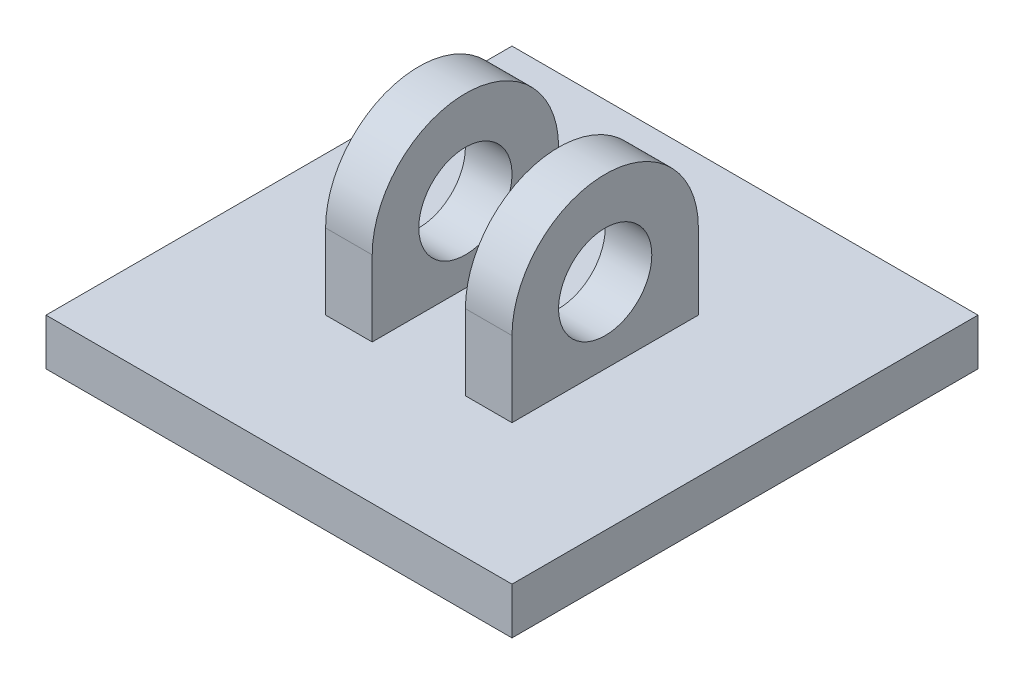
ISO-10303-21;
HEADER;
FILE_DESCRIPTION(('STEP AP214'),'2;1');
FILE_NAME('part.step','',(''),(''),'','','');
FILE_SCHEMA(('AUTOMOTIVE_DESIGN { 1 0 10303 214 1 1 1 1 }'));
ENDSEC;
DATA;
#1=APPLICATION_CONTEXT('core data for automotive mechanical design processes');
#2=APPLICATION_PROTOCOL_DEFINITION('international standard','automotive_design',2000,#1);
#3=PRODUCT_CONTEXT('',#1,'mechanical');
#4=PRODUCT('Part','Part','',(#3));
#5=PRODUCT_RELATED_PRODUCT_CATEGORY('part','',(#4));
#6=PRODUCT_DEFINITION_FORMATION('','',#4);
#7=PRODUCT_DEFINITION_CONTEXT('part definition',#1,'design');
#8=PRODUCT_DEFINITION('design','',#6,#7);
#9=PRODUCT_DEFINITION_SHAPE('','',#8);
#10=(LENGTH_UNIT() NAMED_UNIT(*) SI_UNIT(.MILLI.,.METRE.));
#11=(NAMED_UNIT(*) PLANE_ANGLE_UNIT() SI_UNIT($,.RADIAN.));
#12=(NAMED_UNIT(*) SI_UNIT($,.STERADIAN.) SOLID_ANGLE_UNIT());
#13=UNCERTAINTY_MEASURE_WITH_UNIT(LENGTH_MEASURE(1.E-05),#10,'distance_accuracy_value','');
#14=(GEOMETRIC_REPRESENTATION_CONTEXT(3) GLOBAL_UNCERTAINTY_ASSIGNED_CONTEXT((#13)) GLOBAL_UNIT_ASSIGNED_CONTEXT((#10,
#11,#12)) REPRESENTATION_CONTEXT('',''));
#15=CARTESIAN_POINT('',(0.,0.,0.));
#16=DIRECTION('',(0.,0.,1.));
#17=DIRECTION('',(1.,0.,0.));
#18=AXIS2_PLACEMENT_3D('',#15,#16,#17);
#19=CARTESIAN_POINT('',(-10.,13.097700543262,-25.));
#20=DIRECTION('',(-1.,0.,0.));
#21=DIRECTION('',(0.,0.,-1.));
#22=AXIS2_PLACEMENT_3D('',#19,#20,#21);
#23=PLANE('',#22);
#24=DIRECTION('',(0.,-1.,0.));
#25=VECTOR('',#24,1.);
#26=CARTESIAN_POINT('',(-10.,5.,-15.));
#27=LINE('',#26,#25);
#28=CARTESIAN_POINT('',(-10.,13.097700543262,-15.));
#29=VERTEX_POINT('',#28);
#30=CARTESIAN_POINT('',(-10.,5.,-15.));
#31=VERTEX_POINT('',#30);
#32=EDGE_CURVE('E133',#29,#31,#27,.T.);
#33=ORIENTED_EDGE('',*,*,#32,.F.);
#34=CARTESIAN_POINT('',(-10.,13.097700543262,-25.));
#35=DIRECTION('',(1.,0.,0.));
#36=DIRECTION('',(0.,0.,-1.));
#37=AXIS2_PLACEMENT_3D('',#34,#35,#36);
#38=CIRCLE('',#37,10.);
#39=CARTESIAN_POINT('',(-10.,13.097700543262,-35.));
#40=VERTEX_POINT('',#39);
#41=EDGE_CURVE('E145',#40,#29,#38,.T.);
#42=ORIENTED_EDGE('',*,*,#41,.F.);
#43=DIRECTION('',(0.,1.,0.));
#44=VECTOR('',#43,1.);
#45=CARTESIAN_POINT('',(-10.,5.,-35.));
#46=LINE('',#45,#44);
#47=CARTESIAN_POINT('',(-10.,5.,-35.));
#48=VERTEX_POINT('',#47);
#49=EDGE_CURVE('E153',#48,#40,#46,.T.);
#50=ORIENTED_EDGE('',*,*,#49,.F.);
#51=DIRECTION('',(0.,0.,-1.));
#52=VECTOR('',#51,1.);
#53=CARTESIAN_POINT('',(-10.,5.,-15.));
#54=LINE('',#53,#52);
#55=EDGE_CURVE('E148',#31,#48,#54,.T.);
#56=ORIENTED_EDGE('',*,*,#55,.F.);
#57=EDGE_LOOP('',(#33,#42,#50,#56));
#58=FACE_BOUND('',#57,.T.);
#59=CARTESIAN_POINT('',(-10.,13.097700543262,-25.));
#60=DIRECTION('',(1.,0.,0.));
#61=DIRECTION('',(0.,0.,-1.));
#62=AXIS2_PLACEMENT_3D('',#59,#60,#61);
#63=CIRCLE('',#62,5.);
#64=CARTESIAN_POINT('',(-10.,13.097700543262,-30.));
#65=VERTEX_POINT('',#64);
#66=EDGE_CURVE('E466',#65,#65,#63,.T.);
#67=ORIENTED_EDGE('',*,*,#66,.T.);
#68=EDGE_LOOP('',(#67));
#69=FACE_BOUND('',#68,.T.);
#70=ADVANCED_FACE('F40',(#58,#69),#23,.T.);
#71=CARTESIAN_POINT('',(-5.,13.097700543262,-25.));
#72=DIRECTION('',(-1.,0.,0.));
#73=DIRECTION('',(0.,0.,-1.));
#74=AXIS2_PLACEMENT_3D('',#71,#72,#73);
#75=PLANE('',#74);
#76=DIRECTION('',(0.,-1.,0.));
#77=VECTOR('',#76,1.);
#78=CARTESIAN_POINT('',(-5.,5.,-15.));
#79=LINE('',#78,#77);
#80=CARTESIAN_POINT('',(-5.,13.097700543262,-15.));
#81=VERTEX_POINT('',#80);
#82=CARTESIAN_POINT('',(-5.,5.,-15.));
#83=VERTEX_POINT('',#82);
#84=EDGE_CURVE('E57',#81,#83,#79,.T.);
#85=ORIENTED_EDGE('',*,*,#84,.T.);
#86=DIRECTION('',(0.,0.,-1.));
#87=VECTOR('',#86,1.);
#88=CARTESIAN_POINT('',(-5.,5.,-15.));
#89=LINE('',#88,#87);
#90=CARTESIAN_POINT('',(-5.,5.,-35.));
#91=VERTEX_POINT('',#90);
#92=EDGE_CURVE('E150',#83,#91,#89,.T.);
#93=ORIENTED_EDGE('',*,*,#92,.T.);
#94=DIRECTION('',(0.,1.,0.));
#95=VECTOR('',#94,1.);
#96=CARTESIAN_POINT('',(-5.,5.,-35.));
#97=LINE('',#96,#95);
#98=CARTESIAN_POINT('',(-5.,13.097700543262,-35.));
#99=VERTEX_POINT('',#98);
#100=EDGE_CURVE('E163',#91,#99,#97,.T.);
#101=ORIENTED_EDGE('',*,*,#100,.T.);
#102=CARTESIAN_POINT('',(-5.,13.097700543262,-25.));
#103=DIRECTION('',(1.,0.,0.));
#104=DIRECTION('',(0.,0.,-1.));
#105=AXIS2_PLACEMENT_3D('',#102,#103,#104);
#106=CIRCLE('',#105,10.);
#107=EDGE_CURVE('E161',#99,#81,#106,.T.);
#108=ORIENTED_EDGE('',*,*,#107,.T.);
#109=EDGE_LOOP('',(#85,#93,#101,#108));
#110=FACE_BOUND('',#109,.T.);
#111=CARTESIAN_POINT('',(-5.,13.097700543262,-25.));
#112=DIRECTION('',(-1.,0.,0.));
#113=DIRECTION('',(0.,0.,1.));
#114=AXIS2_PLACEMENT_3D('',#111,#112,#113);
#115=CIRCLE('',#114,5.);
#116=CARTESIAN_POINT('',(-5.,13.097700543262,-20.));
#117=VERTEX_POINT('',#116);
#118=EDGE_CURVE('E44',#117,#117,#115,.F.);
#119=ORIENTED_EDGE('',*,*,#118,.F.);
#120=EDGE_LOOP('',(#119));
#121=FACE_BOUND('',#120,.T.);
#122=ADVANCED_FACE('F249',(#110,#121),#75,.F.);
#123=CARTESIAN_POINT('',(-25.,0.,-50.));
#124=DIRECTION('',(-1.,0.,0.));
#125=DIRECTION('',(0.,-1.,0.));
#126=AXIS2_PLACEMENT_3D('',#123,#124,#125);
#127=PLANE('',#126);
#128=DIRECTION('',(0.,-1.,0.));
#129=VECTOR('',#128,1.);
#130=CARTESIAN_POINT('',(-25.,0.,0.));
#131=LINE('',#130,#129);
#132=CARTESIAN_POINT('',(-25.,5.,0.));
#133=VERTEX_POINT('',#132);
#134=CARTESIAN_POINT('',(-25.,0.,0.));
#135=VERTEX_POINT('',#134);
#136=EDGE_CURVE('E203',#133,#135,#131,.T.);
#137=ORIENTED_EDGE('',*,*,#136,.F.);
#138=DIRECTION('',(0.,0.,1.));
#139=VECTOR('',#138,1.);
#140=CARTESIAN_POINT('',(-25.,5.,-50.));
#141=LINE('',#140,#139);
#142=CARTESIAN_POINT('',(-25.,5.,-50.));
#143=VERTEX_POINT('',#142);
#144=EDGE_CURVE('E11',#143,#133,#141,.T.);
#145=ORIENTED_EDGE('',*,*,#144,.F.);
#146=DIRECTION('',(0.,-1.,0.));
#147=VECTOR('',#146,1.);
#148=CARTESIAN_POINT('',(-25.,0.,-50.));
#149=LINE('',#148,#147);
#150=CARTESIAN_POINT('',(-25.,0.,-50.));
#151=VERTEX_POINT('',#150);
#152=EDGE_CURVE('E204',#143,#151,#149,.T.);
#153=ORIENTED_EDGE('',*,*,#152,.T.);
#154=DIRECTION('',(0.,0.,1.));
#155=VECTOR('',#154,1.);
#156=CARTESIAN_POINT('',(-25.,0.,-50.));
#157=LINE('',#156,#155);
#158=EDGE_CURVE('E217',#151,#135,#157,.T.);
#159=ORIENTED_EDGE('',*,*,#158,.T.);
#160=EDGE_LOOP('',(#137,#145,#153,#159));
#161=FACE_BOUND('',#160,.T.);
#162=ADVANCED_FACE('F42',(#161),#127,.T.);
#163=CARTESIAN_POINT('',(-25.,5.,-50.));
#164=DIRECTION('',(0.,1.,0.));
#165=DIRECTION('',(0.,0.,1.));
#166=AXIS2_PLACEMENT_3D('',#163,#164,#165);
#167=PLANE('',#166);
#168=ORIENTED_EDGE('',*,*,#55,.T.);
#169=DIRECTION('',(1.,0.,0.));
#170=VECTOR('',#169,1.);
#171=CARTESIAN_POINT('',(-10.,5.,-35.));
#172=LINE('',#171,#170);
#173=EDGE_CURVE('E168',#48,#91,#172,.T.);
#174=ORIENTED_EDGE('',*,*,#173,.T.);
#175=ORIENTED_EDGE('',*,*,#92,.F.);
#176=DIRECTION('',(1.,0.,0.));
#177=VECTOR('',#176,1.);
#178=CARTESIAN_POINT('',(-10.,5.,-15.));
#179=LINE('',#178,#177);
#180=EDGE_CURVE('E159',#31,#83,#179,.T.);
#181=ORIENTED_EDGE('',*,*,#180,.F.);
#182=EDGE_LOOP('',(#168,#174,#175,#181));
#183=FACE_BOUND('',#182,.T.);
#184=DIRECTION('',(0.,0.,-1.));
#185=VECTOR('',#184,1.);
#186=CARTESIAN_POINT('',(10.,5.,-15.));
#187=LINE('',#186,#185);
#188=CARTESIAN_POINT('',(10.,5.,-15.));
#189=VERTEX_POINT('',#188);
#190=CARTESIAN_POINT('',(10.,5.,-35.));
#191=VERTEX_POINT('',#190);
#192=EDGE_CURVE('E177',#189,#191,#187,.T.);
#193=ORIENTED_EDGE('',*,*,#192,.F.);
#194=DIRECTION('',(-1.,0.,0.));
#195=VECTOR('',#194,1.);
#196=CARTESIAN_POINT('',(10.,5.,-15.));
#197=LINE('',#196,#195);
#198=CARTESIAN_POINT('',(5.,5.,-15.));
#199=VERTEX_POINT('',#198);
#200=EDGE_CURVE('E200',#189,#199,#197,.T.);
#201=ORIENTED_EDGE('',*,*,#200,.T.);
#202=DIRECTION('',(0.,0.,-1.));
#203=VECTOR('',#202,1.);
#204=CARTESIAN_POINT('',(5.,5.,-15.));
#205=LINE('',#204,#203);
#206=CARTESIAN_POINT('',(5.,5.,-35.));
#207=VERTEX_POINT('',#206);
#208=EDGE_CURVE('E188',#199,#207,#205,.T.);
#209=ORIENTED_EDGE('',*,*,#208,.T.);
#210=DIRECTION('',(-1.,0.,0.));
#211=VECTOR('',#210,1.);
#212=CARTESIAN_POINT('',(10.,5.,-35.));
#213=LINE('',#212,#211);
#214=EDGE_CURVE('E198',#191,#207,#213,.T.);
#215=ORIENTED_EDGE('',*,*,#214,.F.);
#216=EDGE_LOOP('',(#193,#201,#209,#215));
#217=FACE_BOUND('',#216,.T.);
#218=DIRECTION('',(-1.,0.,0.));
#219=VECTOR('',#218,1.);
#220=CARTESIAN_POINT('',(-25.,5.,0.));
#221=LINE('',#220,#219);
#222=CARTESIAN_POINT('',(25.,5.,0.));
#223=VERTEX_POINT('',#222);
#224=EDGE_CURVE('E208',#223,#133,#221,.T.);
#225=ORIENTED_EDGE('',*,*,#224,.F.);
#226=DIRECTION('',(0.,0.,1.));
#227=VECTOR('',#226,1.);
#228=CARTESIAN_POINT('',(25.,5.,-50.));
#229=LINE('',#228,#227);
#230=CARTESIAN_POINT('',(25.,5.,-50.));
#231=VERTEX_POINT('',#230);
#232=EDGE_CURVE('E49',#231,#223,#229,.T.);
#233=ORIENTED_EDGE('',*,*,#232,.F.);
#234=DIRECTION('',(-1.,0.,0.));
#235=VECTOR('',#234,1.);
#236=CARTESIAN_POINT('',(-25.,5.,-50.));
#237=LINE('',#236,#235);
#238=EDGE_CURVE('E214',#231,#143,#237,.T.);
#239=ORIENTED_EDGE('',*,*,#238,.T.);
#240=ORIENTED_EDGE('',*,*,#144,.T.);
#241=EDGE_LOOP('',(#225,#233,#239,#240));
#242=FACE_BOUND('',#241,.T.);
#243=ADVANCED_FACE('F301',(#183,#217,#242),#167,.T.);
#244=CARTESIAN_POINT('',(25.,0.,-50.));
#245=DIRECTION('',(1.,0.,0.));
#246=DIRECTION('',(0.,0.,-1.));
#247=AXIS2_PLACEMENT_3D('',#244,#245,#246);
#248=PLANE('',#247);
#249=DIRECTION('',(0.,1.,0.));
#250=VECTOR('',#249,1.);
#251=CARTESIAN_POINT('',(25.,0.,0.));
#252=LINE('',#251,#250);
#253=CARTESIAN_POINT('',(25.,0.,0.));
#254=VERTEX_POINT('',#253);
#255=EDGE_CURVE('E223',#254,#223,#252,.T.);
#256=ORIENTED_EDGE('',*,*,#255,.F.);
#257=DIRECTION('',(0.,0.,1.));
#258=VECTOR('',#257,1.);
#259=CARTESIAN_POINT('',(25.,0.,-50.));
#260=LINE('',#259,#258);
#261=CARTESIAN_POINT('',(25.,0.,-50.));
#262=VERTEX_POINT('',#261);
#263=EDGE_CURVE('E229',#262,#254,#260,.T.);
#264=ORIENTED_EDGE('',*,*,#263,.F.);
#265=DIRECTION('',(0.,1.,0.));
#266=VECTOR('',#265,1.);
#267=CARTESIAN_POINT('',(25.,0.,-50.));
#268=LINE('',#267,#266);
#269=EDGE_CURVE('E211',#262,#231,#268,.T.);
#270=ORIENTED_EDGE('',*,*,#269,.T.);
#271=ORIENTED_EDGE('',*,*,#232,.T.);
#272=EDGE_LOOP('',(#256,#264,#270,#271));
#273=FACE_BOUND('',#272,.T.);
#274=ADVANCED_FACE('F307',(#273),#248,.T.);
#275=CARTESIAN_POINT('',(-25.,0.,-50.));
#276=DIRECTION('',(0.,-1.,0.));
#277=DIRECTION('',(0.,0.,-1.));
#278=AXIS2_PLACEMENT_3D('',#275,#276,#277);
#279=PLANE('',#278);
#280=DIRECTION('',(1.,0.,0.));
#281=VECTOR('',#280,1.);
#282=CARTESIAN_POINT('',(-25.,0.,0.));
#283=LINE('',#282,#281);
#284=EDGE_CURVE('E220',#135,#254,#283,.T.);
#285=ORIENTED_EDGE('',*,*,#284,.F.);
#286=ORIENTED_EDGE('',*,*,#158,.F.);
#287=DIRECTION('',(1.,0.,0.));
#288=VECTOR('',#287,1.);
#289=CARTESIAN_POINT('',(-25.,0.,-50.));
#290=LINE('',#289,#288);
#291=EDGE_CURVE('E207',#151,#262,#290,.T.);
#292=ORIENTED_EDGE('',*,*,#291,.T.);
#293=ORIENTED_EDGE('',*,*,#263,.T.);
#294=EDGE_LOOP('',(#285,#286,#292,#293));
#295=FACE_BOUND('',#294,.T.);
#296=ADVANCED_FACE('F399',(#295),#279,.T.);
#297=CARTESIAN_POINT('',(-25.,5.,-50.));
#298=DIRECTION('',(0.,0.,-1.));
#299=DIRECTION('',(-1.,0.,0.));
#300=AXIS2_PLACEMENT_3D('',#297,#298,#299);
#301=PLANE('',#300);
#302=ORIENTED_EDGE('',*,*,#152,.F.);
#303=ORIENTED_EDGE('',*,*,#238,.F.);
#304=ORIENTED_EDGE('',*,*,#269,.F.);
#305=ORIENTED_EDGE('',*,*,#291,.F.);
#306=EDGE_LOOP('',(#302,#303,#304,#305));
#307=FACE_BOUND('',#306,.T.);
#308=ADVANCED_FACE('F388',(#307),#301,.T.);
#309=CARTESIAN_POINT('',(-25.,5.,0.));
#310=DIRECTION('',(0.,0.,-1.));
#311=DIRECTION('',(-1.,0.,0.));
#312=AXIS2_PLACEMENT_3D('',#309,#310,#311);
#313=PLANE('',#312);
#314=ORIENTED_EDGE('',*,*,#136,.T.);
#315=ORIENTED_EDGE('',*,*,#284,.T.);
#316=ORIENTED_EDGE('',*,*,#255,.T.);
#317=ORIENTED_EDGE('',*,*,#224,.T.);
#318=EDGE_LOOP('',(#314,#315,#316,#317));
#319=FACE_BOUND('',#318,.T.);
#320=ADVANCED_FACE('F377',(#319),#313,.F.);
#321=CARTESIAN_POINT('',(10.,5.,-15.));
#322=DIRECTION('',(0.,0.,-1.));
#323=DIRECTION('',(-1.,0.,0.));
#324=AXIS2_PLACEMENT_3D('',#321,#322,#323);
#325=PLANE('',#324);
#326=DIRECTION('',(0.,-1.,0.));
#327=VECTOR('',#326,1.);
#328=CARTESIAN_POINT('',(5.,5.,-15.));
#329=LINE('',#328,#327);
#330=CARTESIAN_POINT('',(5.,13.097700543262,-15.));
#331=VERTEX_POINT('',#330);
#332=EDGE_CURVE('E185',#331,#199,#329,.T.);
#333=ORIENTED_EDGE('',*,*,#332,.T.);
#334=ORIENTED_EDGE('',*,*,#200,.F.);
#335=DIRECTION('',(0.,-1.,0.));
#336=VECTOR('',#335,1.);
#337=CARTESIAN_POINT('',(10.,5.,-15.));
#338=LINE('',#337,#336);
#339=CARTESIAN_POINT('',(10.,13.097700543262,-15.));
#340=VERTEX_POINT('',#339);
#341=EDGE_CURVE('E175',#340,#189,#338,.T.);
#342=ORIENTED_EDGE('',*,*,#341,.F.);
#343=DIRECTION('',(-1.,0.,0.));
#344=VECTOR('',#343,1.);
#345=CARTESIAN_POINT('',(10.,13.097700543262,-15.));
#346=LINE('',#345,#344);
#347=EDGE_CURVE('E184',#340,#331,#346,.T.);
#348=ORIENTED_EDGE('',*,*,#347,.T.);
#349=EDGE_LOOP('',(#333,#334,#342,#348));
#350=FACE_BOUND('',#349,.T.);
#351=ADVANCED_FACE('F366',(#350),#325,.F.);
#352=CARTESIAN_POINT('',(10.,5.,-35.));
#353=DIRECTION('',(0.,0.,1.));
#354=DIRECTION('',(1.,0.,0.));
#355=AXIS2_PLACEMENT_3D('',#352,#353,#354);
#356=PLANE('',#355);
#357=DIRECTION('',(0.,1.,0.));
#358=VECTOR('',#357,1.);
#359=CARTESIAN_POINT('',(5.,5.,-35.));
#360=LINE('',#359,#358);
#361=CARTESIAN_POINT('',(5.,13.097700543262,-35.));
#362=VERTEX_POINT('',#361);
#363=EDGE_CURVE('E65',#207,#362,#360,.T.);
#364=ORIENTED_EDGE('',*,*,#363,.T.);
#365=DIRECTION('',(-1.,0.,0.));
#366=VECTOR('',#365,1.);
#367=CARTESIAN_POINT('',(10.,13.097700543262,-35.));
#368=LINE('',#367,#366);
#369=CARTESIAN_POINT('',(10.,13.097700543262,-35.));
#370=VERTEX_POINT('',#369);
#371=EDGE_CURVE('E195',#370,#362,#368,.T.);
#372=ORIENTED_EDGE('',*,*,#371,.F.);
#373=DIRECTION('',(0.,1.,0.));
#374=VECTOR('',#373,1.);
#375=CARTESIAN_POINT('',(10.,5.,-35.));
#376=LINE('',#375,#374);
#377=EDGE_CURVE('E180',#191,#370,#376,.T.);
#378=ORIENTED_EDGE('',*,*,#377,.F.);
#379=ORIENTED_EDGE('',*,*,#214,.T.);
#380=EDGE_LOOP('',(#364,#372,#378,#379));
#381=FACE_BOUND('',#380,.T.);
#382=ADVANCED_FACE('F355',(#381),#356,.F.);
#383=CARTESIAN_POINT('',(10.,13.097700543262,-25.));
#384=DIRECTION('',(-1.,0.,0.));
#385=DIRECTION('',(0.,0.,1.));
#386=AXIS2_PLACEMENT_3D('',#383,#384,#385);
#387=CYLINDRICAL_SURFACE('',#386,10.);
#388=CARTESIAN_POINT('',(5.,13.097700543262,-25.));
#389=DIRECTION('',(1.,0.,0.));
#390=DIRECTION('',(0.,0.,-1.));
#391=AXIS2_PLACEMENT_3D('',#388,#389,#390);
#392=CIRCLE('',#391,10.);
#393=EDGE_CURVE('E178',#362,#331,#392,.T.);
#394=ORIENTED_EDGE('',*,*,#393,.T.);
#395=ORIENTED_EDGE('',*,*,#347,.F.);
#396=CARTESIAN_POINT('',(10.,13.097700543262,-25.));
#397=DIRECTION('',(1.,0.,0.));
#398=DIRECTION('',(0.,0.,-1.));
#399=AXIS2_PLACEMENT_3D('',#396,#397,#398);
#400=CIRCLE('',#399,10.);
#401=EDGE_CURVE('E182',#370,#340,#400,.T.);
#402=ORIENTED_EDGE('',*,*,#401,.F.);
#403=ORIENTED_EDGE('',*,*,#371,.T.);
#404=EDGE_LOOP('',(#394,#395,#402,#403));
#405=FACE_BOUND('',#404,.T.);
#406=ADVANCED_FACE('F345',(#405),#387,.T.);
#407=CARTESIAN_POINT('',(10.,13.097700543262,-25.));
#408=DIRECTION('',(1.,0.,0.));
#409=DIRECTION('',(0.,0.,-1.));
#410=AXIS2_PLACEMENT_3D('',#407,#408,#409);
#411=PLANE('',#410);
#412=CARTESIAN_POINT('',(10.,13.097700543262,-25.));
#413=DIRECTION('',(1.,0.,0.));
#414=DIRECTION('',(0.,0.,-1.));
#415=AXIS2_PLACEMENT_3D('',#412,#413,#414);
#416=CIRCLE('',#415,5.);
#417=CARTESIAN_POINT('',(10.,13.097700543262,-30.));
#418=VERTEX_POINT('',#417);
#419=EDGE_CURVE('E138',#418,#418,#416,.T.);
#420=ORIENTED_EDGE('',*,*,#419,.F.);
#421=EDGE_LOOP('',(#420));
#422=FACE_BOUND('',#421,.T.);
#423=ORIENTED_EDGE('',*,*,#341,.T.);
#424=ORIENTED_EDGE('',*,*,#192,.T.);
#425=ORIENTED_EDGE('',*,*,#377,.T.);
#426=ORIENTED_EDGE('',*,*,#401,.T.);
#427=EDGE_LOOP('',(#423,#424,#425,#426));
#428=FACE_BOUND('',#427,.T.);
#429=ADVANCED_FACE('F245',(#422,#428),#411,.T.);
#430=CARTESIAN_POINT('',(5.,13.097700543262,-25.));
#431=DIRECTION('',(1.,0.,0.));
#432=DIRECTION('',(0.,0.,-1.));
#433=AXIS2_PLACEMENT_3D('',#430,#431,#432);
#434=PLANE('',#433);
#435=CARTESIAN_POINT('',(5.,13.097700543262,-25.));
#436=DIRECTION('',(1.,0.,0.));
#437=DIRECTION('',(0.,0.,-1.));
#438=AXIS2_PLACEMENT_3D('',#435,#436,#437);
#439=CIRCLE('',#438,5.);
#440=CARTESIAN_POINT('',(5.,13.097700543262,-30.));
#441=VERTEX_POINT('',#440);
#442=EDGE_CURVE('E174',#441,#441,#439,.T.);
#443=ORIENTED_EDGE('',*,*,#442,.T.);
#444=EDGE_LOOP('',(#443));
#445=FACE_BOUND('',#444,.T.);
#446=ORIENTED_EDGE('',*,*,#332,.F.);
#447=ORIENTED_EDGE('',*,*,#393,.F.);
#448=ORIENTED_EDGE('',*,*,#363,.F.);
#449=ORIENTED_EDGE('',*,*,#208,.F.);
#450=EDGE_LOOP('',(#446,#447,#448,#449));
#451=FACE_BOUND('',#450,.T.);
#452=ADVANCED_FACE('F234',(#445,#451),#434,.F.);
#453=CARTESIAN_POINT('',(-25.,13.097700543262,-25.));
#454=DIRECTION('',(1.,0.,0.));
#455=DIRECTION('',(0.,0.,-1.));
#456=AXIS2_PLACEMENT_3D('',#453,#454,#455);
#457=CYLINDRICAL_SURFACE('',#456,5.);
#458=ORIENTED_EDGE('',*,*,#419,.T.);
#459=EDGE_LOOP('',(#458));
#460=FACE_BOUND('',#459,.T.);
#461=ORIENTED_EDGE('',*,*,#442,.F.);
#462=EDGE_LOOP('',(#461));
#463=FACE_BOUND('',#462,.T.);
#464=ADVANCED_FACE('F236',(#460,#463),#457,.F.);
#465=CARTESIAN_POINT('',(-10.,5.,-15.));
#466=DIRECTION('',(0.,0.,1.));
#467=DIRECTION('',(1.,0.,0.));
#468=AXIS2_PLACEMENT_3D('',#465,#466,#467);
#469=PLANE('',#468);
#470=ORIENTED_EDGE('',*,*,#84,.F.);
#471=DIRECTION('',(1.,0.,0.));
#472=VECTOR('',#471,1.);
#473=CARTESIAN_POINT('',(-10.,13.097700543262,-15.));
#474=LINE('',#473,#472);
#475=EDGE_CURVE('E130',#29,#81,#474,.T.);
#476=ORIENTED_EDGE('',*,*,#475,.F.);
#477=ORIENTED_EDGE('',*,*,#32,.T.);
#478=ORIENTED_EDGE('',*,*,#180,.T.);
#479=EDGE_LOOP('',(#470,#476,#477,#478));
#480=FACE_BOUND('',#479,.T.);
#481=ADVANCED_FACE('F132',(#480),#469,.T.);
#482=CARTESIAN_POINT('',(-10.,13.097700543262,-25.));
#483=DIRECTION('',(1.,0.,0.));
#484=DIRECTION('',(0.,0.,-1.));
#485=AXIS2_PLACEMENT_3D('',#482,#483,#484);
#486=CYLINDRICAL_SURFACE('',#485,10.);
#487=ORIENTED_EDGE('',*,*,#107,.F.);
#488=DIRECTION('',(1.,0.,0.));
#489=VECTOR('',#488,1.);
#490=CARTESIAN_POINT('',(-10.,13.097700543262,-35.));
#491=LINE('',#490,#489);
#492=EDGE_CURVE('E139',#40,#99,#491,.T.);
#493=ORIENTED_EDGE('',*,*,#492,.F.);
#494=ORIENTED_EDGE('',*,*,#41,.T.);
#495=ORIENTED_EDGE('',*,*,#475,.T.);
#496=EDGE_LOOP('',(#487,#493,#494,#495));
#497=FACE_BOUND('',#496,.T.);
#498=ADVANCED_FACE('F152',(#497),#486,.T.);
#499=CARTESIAN_POINT('',(-10.,5.,-35.));
#500=DIRECTION('',(0.,0.,-1.));
#501=DIRECTION('',(-1.,0.,0.));
#502=AXIS2_PLACEMENT_3D('',#499,#500,#501);
#503=PLANE('',#502);
#504=ORIENTED_EDGE('',*,*,#100,.F.);
#505=ORIENTED_EDGE('',*,*,#173,.F.);
#506=ORIENTED_EDGE('',*,*,#49,.T.);
#507=ORIENTED_EDGE('',*,*,#492,.T.);
#508=EDGE_LOOP('',(#504,#505,#506,#507));
#509=FACE_BOUND('',#508,.T.);
#510=ADVANCED_FACE('F258',(#509),#503,.T.);
#511=CARTESIAN_POINT('',(25.,13.097700543262,-25.));
#512=DIRECTION('',(-1.,0.,0.));
#513=DIRECTION('',(0.,0.,1.));
#514=AXIS2_PLACEMENT_3D('',#511,#512,#513);
#515=CYLINDRICAL_SURFACE('',#514,5.);
#516=ORIENTED_EDGE('',*,*,#66,.F.);
#517=EDGE_LOOP('',(#516));
#518=FACE_BOUND('',#517,.T.);
#519=ORIENTED_EDGE('',*,*,#118,.T.);
#520=EDGE_LOOP('',(#519));
#521=FACE_BOUND('',#520,.T.);
#522=ADVANCED_FACE('F256',(#518,#521),#515,.F.);
#523=CLOSED_SHELL('',(#70,#122,#162,#243,#274,#296,#308,#320,#351,#382,#406,#429,#452,#464,#481,
#498,#510,#522));
#524=MANIFOLD_SOLID_BREP('B2',#523);
#525=ADVANCED_BREP_SHAPE_REPRESENTATION('',(#18,#524),#14);
#526=SHAPE_DEFINITION_REPRESENTATION(#9,#525);
ENDSEC;
END-ISO-10303-21;
